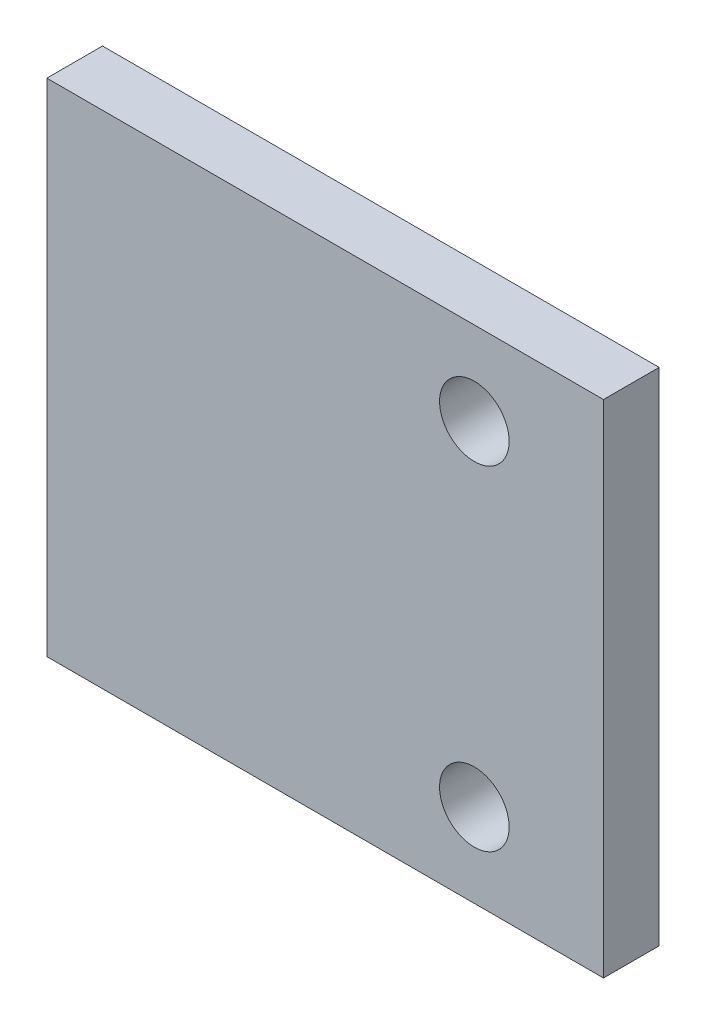
ISO-10303-21;
HEADER;
FILE_DESCRIPTION(('STEP AP214'),'2;1');
FILE_NAME('part.step','',(''),(''),'','','');
FILE_SCHEMA(('AUTOMOTIVE_DESIGN { 1 0 10303 214 1 1 1 1 }'));
ENDSEC;
DATA;
#1=APPLICATION_CONTEXT('core data for automotive mechanical design processes');
#2=APPLICATION_PROTOCOL_DEFINITION('international standard','automotive_design',2000,#1);
#3=PRODUCT_CONTEXT('',#1,'mechanical');
#4=PRODUCT('Part','Part','',(#3));
#5=PRODUCT_RELATED_PRODUCT_CATEGORY('part','',(#4));
#6=PRODUCT_DEFINITION_FORMATION('','',#4);
#7=PRODUCT_DEFINITION_CONTEXT('part definition',#1,'design');
#8=PRODUCT_DEFINITION('design','',#6,#7);
#9=PRODUCT_DEFINITION_SHAPE('','',#8);
#10=(LENGTH_UNIT() NAMED_UNIT(*) SI_UNIT(.MILLI.,.METRE.));
#11=(NAMED_UNIT(*) PLANE_ANGLE_UNIT() SI_UNIT($,.RADIAN.));
#12=(NAMED_UNIT(*) SI_UNIT($,.STERADIAN.) SOLID_ANGLE_UNIT());
#13=UNCERTAINTY_MEASURE_WITH_UNIT(LENGTH_MEASURE(1.E-05),#10,'distance_accuracy_value','');
#14=(GEOMETRIC_REPRESENTATION_CONTEXT(3) GLOBAL_UNCERTAINTY_ASSIGNED_CONTEXT((#13)) GLOBAL_UNIT_ASSIGNED_CONTEXT((#10,
#11,#12)) REPRESENTATION_CONTEXT('',''));
#15=CARTESIAN_POINT('',(0.,0.,0.));
#16=DIRECTION('',(0.,0.,1.));
#17=DIRECTION('',(1.,0.,0.));
#18=AXIS2_PLACEMENT_3D('',#15,#16,#17);
#19=CARTESIAN_POINT('',(0.,0.,2.));
#20=DIRECTION('',(0.,0.,1.));
#21=DIRECTION('',(1.,0.,0.));
#22=AXIS2_PLACEMENT_3D('',#19,#20,#21);
#23=PLANE('',#22);
#24=CARTESIAN_POINT('',(7.65296576801314,1.8491879350348,2.));
#25=DIRECTION('',(0.,0.,1.));
#26=DIRECTION('',(1.,0.,0.));
#27=AXIS2_PLACEMENT_3D('',#24,#25,#26);
#28=CIRCLE('',#27,1.25);
#29=CARTESIAN_POINT('',(8.90296576801314,1.8491879350348,2.));
#30=VERTEX_POINT('',#29);
#31=EDGE_CURVE('E100',#30,#30,#28,.T.);
#32=ORIENTED_EDGE('',*,*,#31,.F.);
#33=EDGE_LOOP('',(#32));
#34=FACE_BOUND('',#33,.T.);
#35=DIRECTION('',(0.,-1.,0.));
#36=VECTOR('',#35,1.);
#37=CARTESIAN_POINT('',(-7.70666300228847,4.8491879350348,2.));
#38=LINE('',#37,#36);
#39=CARTESIAN_POINT('',(-7.70666300228847,4.8491879350348,2.));
#40=VERTEX_POINT('',#39);
#41=CARTESIAN_POINT('',(-7.70666300228847,-13.1508120649652,2.));
#42=VERTEX_POINT('',#41);
#43=EDGE_CURVE('E85',#40,#42,#38,.T.);
#44=ORIENTED_EDGE('',*,*,#43,.T.);
#45=DIRECTION('',(1.,0.,0.));
#46=VECTOR('',#45,1.);
#47=CARTESIAN_POINT('',(-7.70666300228847,-13.1508120649652,2.));
#48=LINE('',#47,#46);
#49=CARTESIAN_POINT('',(12.2933369977115,-13.1508120649652,2.));
#50=VERTEX_POINT('',#49);
#51=EDGE_CURVE('E80',#42,#50,#48,.T.);
#52=ORIENTED_EDGE('',*,*,#51,.T.);
#53=DIRECTION('',(0.,1.,0.));
#54=VECTOR('',#53,1.);
#55=CARTESIAN_POINT('',(12.2933369977115,4.8491879350348,2.));
#56=LINE('',#55,#54);
#57=CARTESIAN_POINT('',(12.2933369977115,4.8491879350348,2.));
#58=VERTEX_POINT('',#57);
#59=EDGE_CURVE('E83',#50,#58,#56,.T.);
#60=ORIENTED_EDGE('',*,*,#59,.T.);
#61=DIRECTION('',(-1.,0.,0.));
#62=VECTOR('',#61,1.);
#63=CARTESIAN_POINT('',(-7.70666300228847,4.8491879350348,2.));
#64=LINE('',#63,#62);
#65=EDGE_CURVE('E50',#58,#40,#64,.T.);
#66=ORIENTED_EDGE('',*,*,#65,.T.);
#67=EDGE_LOOP('',(#44,#52,#60,#66));
#68=FACE_BOUND('',#67,.T.);
#69=CARTESIAN_POINT('',(7.65296576801314,-10.1508120649652,2.));
#70=DIRECTION('',(0.,0.,1.));
#71=DIRECTION('',(1.,0.,0.));
#72=AXIS2_PLACEMENT_3D('',#69,#70,#71);
#73=CIRCLE('',#72,1.25);
#74=CARTESIAN_POINT('',(8.90296576801314,-10.1508120649652,2.));
#75=VERTEX_POINT('',#74);
#76=EDGE_CURVE('E115',#75,#75,#73,.T.);
#77=ORIENTED_EDGE('',*,*,#76,.F.);
#78=EDGE_LOOP('',(#77));
#79=FACE_BOUND('',#78,.T.);
#80=ADVANCED_FACE('F33',(#34,#68,#79),#23,.T.);
#81=CARTESIAN_POINT('',(0.,0.,0.));
#82=DIRECTION('',(0.,0.,1.));
#83=DIRECTION('',(1.,0.,0.));
#84=AXIS2_PLACEMENT_3D('',#81,#82,#83);
#85=PLANE('',#84);
#86=DIRECTION('',(0.,-1.,0.));
#87=VECTOR('',#86,1.);
#88=CARTESIAN_POINT('',(-7.70666300228847,4.8491879350348,0.));
#89=LINE('',#88,#87);
#90=CARTESIAN_POINT('',(-7.70666300228847,4.8491879350348,0.));
#91=VERTEX_POINT('',#90);
#92=CARTESIAN_POINT('',(-7.70666300228847,-13.1508120649652,0.));
#93=VERTEX_POINT('',#92);
#94=EDGE_CURVE('E97',#91,#93,#89,.T.);
#95=ORIENTED_EDGE('',*,*,#94,.F.);
#96=DIRECTION('',(-1.,0.,0.));
#97=VECTOR('',#96,1.);
#98=CARTESIAN_POINT('',(-7.70666300228847,4.8491879350348,0.));
#99=LINE('',#98,#97);
#100=CARTESIAN_POINT('',(12.2933369977115,4.8491879350348,0.));
#101=VERTEX_POINT('',#100);
#102=EDGE_CURVE('E73',#101,#91,#99,.T.);
#103=ORIENTED_EDGE('',*,*,#102,.F.);
#104=DIRECTION('',(0.,1.,0.));
#105=VECTOR('',#104,1.);
#106=CARTESIAN_POINT('',(12.2933369977115,4.8491879350348,0.));
#107=LINE('',#106,#105);
#108=CARTESIAN_POINT('',(12.2933369977115,-13.1508120649652,0.));
#109=VERTEX_POINT('',#108);
#110=EDGE_CURVE('E67',#109,#101,#107,.T.);
#111=ORIENTED_EDGE('',*,*,#110,.F.);
#112=DIRECTION('',(1.,0.,0.));
#113=VECTOR('',#112,1.);
#114=CARTESIAN_POINT('',(-7.70666300228847,-13.1508120649652,0.));
#115=LINE('',#114,#113);
#116=EDGE_CURVE('E89',#93,#109,#115,.T.);
#117=ORIENTED_EDGE('',*,*,#116,.F.);
#118=EDGE_LOOP('',(#95,#103,#111,#117));
#119=FACE_BOUND('',#118,.T.);
#120=CARTESIAN_POINT('',(7.65296576801314,1.8491879350348,0.));
#121=DIRECTION('',(0.,0.,1.));
#122=DIRECTION('',(1.,0.,0.));
#123=AXIS2_PLACEMENT_3D('',#120,#121,#122);
#124=CIRCLE('',#123,1.25);
#125=CARTESIAN_POINT('',(8.90296576801314,1.8491879350348,0.));
#126=VERTEX_POINT('',#125);
#127=EDGE_CURVE('E112',#126,#126,#124,.T.);
#128=ORIENTED_EDGE('',*,*,#127,.T.);
#129=EDGE_LOOP('',(#128));
#130=FACE_BOUND('',#129,.T.);
#131=CARTESIAN_POINT('',(7.65296576801314,-10.1508120649652,0.));
#132=DIRECTION('',(0.,0.,1.));
#133=DIRECTION('',(1.,0.,0.));
#134=AXIS2_PLACEMENT_3D('',#131,#132,#133);
#135=CIRCLE('',#134,1.25);
#136=CARTESIAN_POINT('',(8.90296576801314,-10.1508120649652,0.));
#137=VERTEX_POINT('',#136);
#138=EDGE_CURVE('E118',#137,#137,#135,.T.);
#139=ORIENTED_EDGE('',*,*,#138,.T.);
#140=EDGE_LOOP('',(#139));
#141=FACE_BOUND('',#140,.T.);
#142=ADVANCED_FACE('F108',(#119,#130,#141),#85,.F.);
#143=CARTESIAN_POINT('',(-7.70666300228847,4.8491879350348,2.));
#144=DIRECTION('',(1.,0.,0.));
#145=DIRECTION('',(0.,1.,0.));
#146=AXIS2_PLACEMENT_3D('',#143,#144,#145);
#147=PLANE('',#146);
#148=ORIENTED_EDGE('',*,*,#94,.T.);
#149=DIRECTION('',(0.,0.,-1.));
#150=VECTOR('',#149,1.);
#151=CARTESIAN_POINT('',(-7.70666300228847,-13.1508120649652,2.));
#152=LINE('',#151,#150);
#153=EDGE_CURVE('E11',#42,#93,#152,.T.);
#154=ORIENTED_EDGE('',*,*,#153,.F.);
#155=ORIENTED_EDGE('',*,*,#43,.F.);
#156=DIRECTION('',(0.,0.,-1.));
#157=VECTOR('',#156,1.);
#158=CARTESIAN_POINT('',(-7.70666300228847,4.8491879350348,2.));
#159=LINE('',#158,#157);
#160=EDGE_CURVE('E93',#40,#91,#159,.T.);
#161=ORIENTED_EDGE('',*,*,#160,.T.);
#162=EDGE_LOOP('',(#148,#154,#155,#161));
#163=FACE_BOUND('',#162,.T.);
#164=ADVANCED_FACE('F35',(#163),#147,.F.);
#165=CARTESIAN_POINT('',(-7.70666300228847,-13.1508120649652,2.));
#166=DIRECTION('',(0.,1.,0.));
#167=DIRECTION('',(0.,0.,1.));
#168=AXIS2_PLACEMENT_3D('',#165,#166,#167);
#169=PLANE('',#168);
#170=ORIENTED_EDGE('',*,*,#116,.T.);
#171=DIRECTION('',(0.,0.,-1.));
#172=VECTOR('',#171,1.);
#173=CARTESIAN_POINT('',(12.2933369977115,-13.1508120649652,2.));
#174=LINE('',#173,#172);
#175=EDGE_CURVE('E42',#50,#109,#174,.T.);
#176=ORIENTED_EDGE('',*,*,#175,.F.);
#177=ORIENTED_EDGE('',*,*,#51,.F.);
#178=ORIENTED_EDGE('',*,*,#153,.T.);
#179=EDGE_LOOP('',(#170,#176,#177,#178));
#180=FACE_BOUND('',#179,.T.);
#181=ADVANCED_FACE('F88',(#180),#169,.F.);
#182=CARTESIAN_POINT('',(12.2933369977115,4.8491879350348,2.));
#183=DIRECTION('',(-1.,0.,0.));
#184=DIRECTION('',(0.,-1.,0.));
#185=AXIS2_PLACEMENT_3D('',#182,#183,#184);
#186=PLANE('',#185);
#187=ORIENTED_EDGE('',*,*,#110,.T.);
#188=DIRECTION('',(0.,0.,-1.));
#189=VECTOR('',#188,1.);
#190=CARTESIAN_POINT('',(12.2933369977115,4.8491879350348,2.));
#191=LINE('',#190,#189);
#192=EDGE_CURVE('E90',#58,#101,#191,.T.);
#193=ORIENTED_EDGE('',*,*,#192,.F.);
#194=ORIENTED_EDGE('',*,*,#59,.F.);
#195=ORIENTED_EDGE('',*,*,#175,.T.);
#196=EDGE_LOOP('',(#187,#193,#194,#195));
#197=FACE_BOUND('',#196,.T.);
#198=ADVANCED_FACE('F91',(#197),#186,.F.);
#199=CARTESIAN_POINT('',(-7.70666300228847,4.8491879350348,2.));
#200=DIRECTION('',(0.,-1.,0.));
#201=DIRECTION('',(0.,0.,-1.));
#202=AXIS2_PLACEMENT_3D('',#199,#200,#201);
#203=PLANE('',#202);
#204=ORIENTED_EDGE('',*,*,#102,.T.);
#205=ORIENTED_EDGE('',*,*,#160,.F.);
#206=ORIENTED_EDGE('',*,*,#65,.F.);
#207=ORIENTED_EDGE('',*,*,#192,.T.);
#208=EDGE_LOOP('',(#204,#205,#206,#207));
#209=FACE_BOUND('',#208,.T.);
#210=ADVANCED_FACE('F105',(#209),#203,.F.);
#211=CARTESIAN_POINT('',(7.65296576801314,1.8491879350348,2.));
#212=DIRECTION('',(0.,0.,-1.));
#213=DIRECTION('',(-1.,0.,0.));
#214=AXIS2_PLACEMENT_3D('',#211,#212,#213);
#215=CYLINDRICAL_SURFACE('',#214,1.25);
#216=ORIENTED_EDGE('',*,*,#31,.T.);
#217=EDGE_LOOP('',(#216));
#218=FACE_BOUND('',#217,.T.);
#219=ORIENTED_EDGE('',*,*,#127,.F.);
#220=EDGE_LOOP('',(#219));
#221=FACE_BOUND('',#220,.T.);
#222=ADVANCED_FACE('F135',(#218,#221),#215,.F.);
#223=CARTESIAN_POINT('',(7.65296576801314,-10.1508120649652,2.));
#224=DIRECTION('',(0.,0.,-1.));
#225=DIRECTION('',(-1.,0.,0.));
#226=AXIS2_PLACEMENT_3D('',#223,#224,#225);
#227=CYLINDRICAL_SURFACE('',#226,1.25);
#228=ORIENTED_EDGE('',*,*,#76,.T.);
#229=EDGE_LOOP('',(#228));
#230=FACE_BOUND('',#229,.T.);
#231=ORIENTED_EDGE('',*,*,#138,.F.);
#232=EDGE_LOOP('',(#231));
#233=FACE_BOUND('',#232,.T.);
#234=ADVANCED_FACE('F124',(#230,#233),#227,.F.);
#235=CLOSED_SHELL('',(#80,#142,#164,#181,#198,#210,#222,#234));
#236=MANIFOLD_SOLID_BREP('B2',#235);
#237=ADVANCED_BREP_SHAPE_REPRESENTATION('',(#18,#236),#14);
#238=SHAPE_DEFINITION_REPRESENTATION(#9,#237);
ENDSEC;
END-ISO-10303-21;
